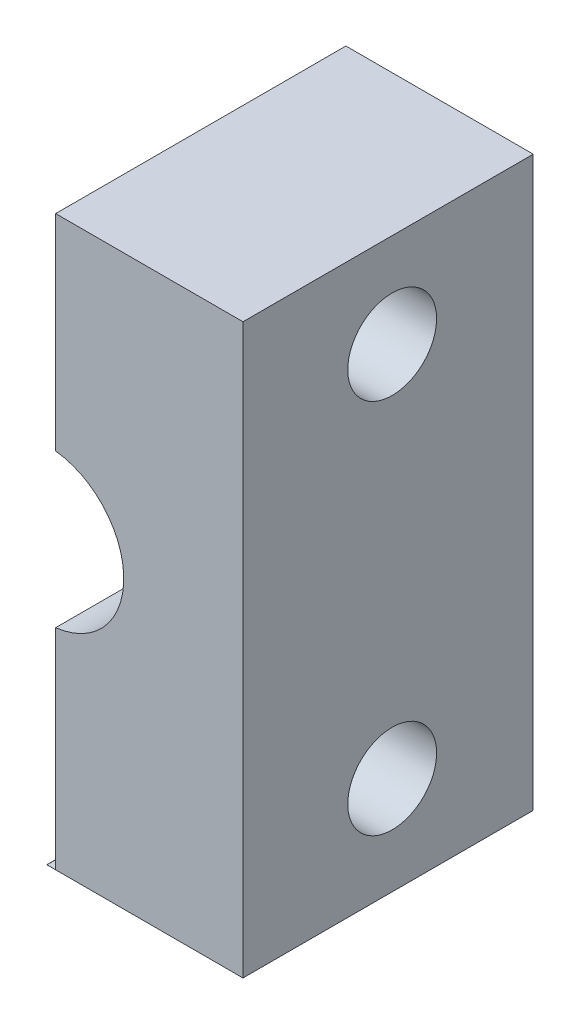
ISO-10303-21;
HEADER;
FILE_DESCRIPTION(('STEP AP214'),'2;1');
FILE_NAME('part.step','',(''),(''),'','','');
FILE_SCHEMA(('AUTOMOTIVE_DESIGN { 1 0 10303 214 1 1 1 1 }'));
ENDSEC;
DATA;
#1=APPLICATION_CONTEXT('core data for automotive mechanical design processes');
#2=APPLICATION_PROTOCOL_DEFINITION('international standard','automotive_design',2000,#1);
#3=PRODUCT_CONTEXT('',#1,'mechanical');
#4=PRODUCT('Part','Part','',(#3));
#5=PRODUCT_RELATED_PRODUCT_CATEGORY('part','',(#4));
#6=PRODUCT_DEFINITION_FORMATION('','',#4);
#7=PRODUCT_DEFINITION_CONTEXT('part definition',#1,'design');
#8=PRODUCT_DEFINITION('design','',#6,#7);
#9=PRODUCT_DEFINITION_SHAPE('','',#8);
#10=(LENGTH_UNIT() NAMED_UNIT(*) SI_UNIT(.MILLI.,.METRE.));
#11=(NAMED_UNIT(*) PLANE_ANGLE_UNIT() SI_UNIT($,.RADIAN.));
#12=(NAMED_UNIT(*) SI_UNIT($,.STERADIAN.) SOLID_ANGLE_UNIT());
#13=UNCERTAINTY_MEASURE_WITH_UNIT(LENGTH_MEASURE(1.E-05),#10,'distance_accuracy_value','');
#14=(GEOMETRIC_REPRESENTATION_CONTEXT(3) GLOBAL_UNCERTAINTY_ASSIGNED_CONTEXT((#13)) GLOBAL_UNIT_ASSIGNED_CONTEXT((#10,
#11,#12)) REPRESENTATION_CONTEXT('',''));
#15=CARTESIAN_POINT('',(0.,0.,0.));
#16=DIRECTION('',(0.,0.,1.));
#17=DIRECTION('',(1.,0.,0.));
#18=AXIS2_PLACEMENT_3D('',#15,#16,#17);
#19=CARTESIAN_POINT('',(-46.55,-9.6635978542281,9.8));
#20=DIRECTION('',(0.,1.,0.));
#21=DIRECTION('',(0.,0.,1.));
#22=AXIS2_PLACEMENT_3D('',#19,#20,#21);
#23=PLANE('',#22);
#24=DIRECTION('',(1.,0.,0.));
#25=VECTOR('',#24,1.);
#26=CARTESIAN_POINT('',(-46.55,-9.6635978542281,0.));
#27=LINE('',#26,#25);
#28=CARTESIAN_POINT('',(-46.55,-9.6635978542281,0.));
#29=VERTEX_POINT('',#28);
#30=CARTESIAN_POINT('',(-46.25,-9.6635978542281,0.));
#31=VERTEX_POINT('',#30);
#32=EDGE_CURVE('E44',#29,#31,#27,.T.);
#33=ORIENTED_EDGE('',*,*,#32,.T.);
#34=DIRECTION('',(0.,0.,1.));
#35=VECTOR('',#34,1.);
#36=CARTESIAN_POINT('',(-46.25,-9.6635978542281,9.8));
#37=LINE('',#36,#35);
#38=CARTESIAN_POINT('',(-46.25,-9.6635978542281,9.8));
#39=VERTEX_POINT('',#38);
#40=EDGE_CURVE('E72',#31,#39,#37,.T.);
#41=ORIENTED_EDGE('',*,*,#40,.T.);
#42=DIRECTION('',(1.,0.,0.));
#43=VECTOR('',#42,1.);
#44=CARTESIAN_POINT('',(-46.55,-9.6635978542281,9.8));
#45=LINE('',#44,#43);
#46=CARTESIAN_POINT('',(-46.55,-9.6635978542281,9.8));
#47=VERTEX_POINT('',#46);
#48=EDGE_CURVE('E89',#47,#39,#45,.T.);
#49=ORIENTED_EDGE('',*,*,#48,.F.);
#50=DIRECTION('',(0.,0.,-1.));
#51=VECTOR('',#50,1.);
#52=CARTESIAN_POINT('',(-46.55,-9.6635978542281,9.8));
#53=LINE('',#52,#51);
#54=EDGE_CURVE('E56',#47,#29,#53,.T.);
#55=ORIENTED_EDGE('',*,*,#54,.T.);
#56=EDGE_LOOP('',(#33,#41,#49,#55));
#57=FACE_BOUND('',#56,.T.);
#58=ADVANCED_FACE('F41',(#57),#23,.F.);
#59=CARTESIAN_POINT('',(-46.55,-4.26952432338381E-13,9.8));
#60=DIRECTION('',(0.,0.,-1.));
#61=DIRECTION('',(-1.,0.,0.));
#62=AXIS2_PLACEMENT_3D('',#59,#60,#61);
#63=PLANE('',#62);
#64=ORIENTED_EDGE('',*,*,#48,.T.);
#65=DIRECTION('',(0.999814280656352,-0.0192718498235664,0.));
#66=VECTOR('',#65,1.);
#67=CARTESIAN_POINT('',(-46.5391587007763,-9.65802419603542,9.8));
#68=LINE('',#67,#66);
#69=CARTESIAN_POINT('',(-46.5391587007763,-9.65802419603542,9.8));
#70=VERTEX_POINT('',#69);
#71=EDGE_CURVE('E79',#70,#39,#68,.T.);
#72=ORIENTED_EDGE('',*,*,#71,.F.);
#73=DIRECTION('',(0.889350089088285,0.457226879173413,0.));
#74=VECTOR('',#73,1.);
#75=CARTESIAN_POINT('',(-46.55,-9.6635978542281,9.8));
#76=LINE('',#75,#74);
#77=EDGE_CURVE('E12',#47,#70,#76,.T.);
#78=ORIENTED_EDGE('',*,*,#77,.F.);
#79=EDGE_LOOP('',(#64,#72,#78));
#80=FACE_BOUND('',#79,.T.);
#81=ADVANCED_FACE('F97',(#80),#63,.F.);
#82=CARTESIAN_POINT('',(-46.55,-4.26952432338381E-13,0.));
#83=DIRECTION('',(0.,0.,-1.));
#84=DIRECTION('',(-1.,0.,0.));
#85=AXIS2_PLACEMENT_3D('',#82,#83,#84);
#86=PLANE('',#85);
#87=DIRECTION('',(0.999814280656352,-0.0192718498235664,0.));
#88=VECTOR('',#87,1.);
#89=CARTESIAN_POINT('',(-46.5391587007763,-9.65802419603542,0.));
#90=LINE('',#89,#88);
#91=CARTESIAN_POINT('',(-46.5391587007763,-9.65802419603542,0.));
#92=VERTEX_POINT('',#91);
#93=EDGE_CURVE('E76',#92,#31,#90,.T.);
#94=ORIENTED_EDGE('',*,*,#93,.T.);
#95=ORIENTED_EDGE('',*,*,#32,.F.);
#96=DIRECTION('',(0.889350089088285,0.457226879173413,0.));
#97=VECTOR('',#96,1.);
#98=CARTESIAN_POINT('',(-46.55,-9.6635978542281,0.));
#99=LINE('',#98,#97);
#100=EDGE_CURVE('E88',#29,#92,#99,.T.);
#101=ORIENTED_EDGE('',*,*,#100,.T.);
#102=EDGE_LOOP('',(#94,#95,#101));
#103=FACE_BOUND('',#102,.T.);
#104=ADVANCED_FACE('F87',(#103),#86,.T.);
#105=CARTESIAN_POINT('',(-46.5391587007763,-9.65802419603542,0.));
#106=DIRECTION('',(-0.0192718498235664,-0.999814280656352,0.));
#107=DIRECTION('',(0.999814280656352,-0.0192718498235664,0.));
#108=AXIS2_PLACEMENT_3D('',#105,#106,#107);
#109=PLANE('',#108);
#110=ORIENTED_EDGE('',*,*,#71,.T.);
#111=ORIENTED_EDGE('',*,*,#40,.F.);
#112=ORIENTED_EDGE('',*,*,#93,.F.);
#113=DIRECTION('',(0.,0.,1.));
#114=VECTOR('',#113,1.);
#115=CARTESIAN_POINT('',(-46.5391587007763,-9.65802419603542,0.));
#116=LINE('',#115,#114);
#117=EDGE_CURVE('E50',#92,#70,#116,.T.);
#118=ORIENTED_EDGE('',*,*,#117,.T.);
#119=EDGE_LOOP('',(#110,#111,#112,#118));
#120=FACE_BOUND('',#119,.T.);
#121=ADVANCED_FACE('F74',(#120),#109,.F.);
#122=CARTESIAN_POINT('',(-46.55,-9.6635978542281,0.));
#123=DIRECTION('',(0.457226879173414,-0.889350089088285,0.));
#124=DIRECTION('',(0.889350089088285,0.457226879173413,0.));
#125=AXIS2_PLACEMENT_3D('',#122,#123,#124);
#126=PLANE('',#125);
#127=ORIENTED_EDGE('',*,*,#77,.T.);
#128=ORIENTED_EDGE('',*,*,#117,.F.);
#129=ORIENTED_EDGE('',*,*,#100,.F.);
#130=ORIENTED_EDGE('',*,*,#54,.F.);
#131=EDGE_LOOP('',(#127,#128,#129,#130));
#132=FACE_BOUND('',#131,.T.);
#133=ADVANCED_FACE('F95',(#132),#126,.F.);
#134=CLOSED_SHELL('',(#58,#81,#104,#121,#133));
#135=MANIFOLD_SOLID_BREP('B2',#134);
#136=CARTESIAN_POINT('',(-46.55,-4.26952432338381E-13,9.8));
#137=DIRECTION('',(0.,0.,-1.));
#138=DIRECTION('',(-1.,0.,0.));
#139=AXIS2_PLACEMENT_3D('',#136,#137,#138);
#140=PLANE('',#139);
#141=DIRECTION('',(-1.,0.,0.));
#142=VECTOR('',#141,1.);
#143=CARTESIAN_POINT('',(-46.55,9.525,9.8));
#144=LINE('',#143,#142);
#145=CARTESIAN_POINT('',(-39.925,9.525,9.8));
#146=VERTEX_POINT('',#145);
#147=CARTESIAN_POINT('',(-46.25,9.525,9.8));
#148=VERTEX_POINT('',#147);
#149=EDGE_CURVE('E224',#146,#148,#144,.T.);
#150=ORIENTED_EDGE('',*,*,#149,.T.);
#151=DIRECTION('',(0.,1.,0.));
#152=VECTOR('',#151,1.);
#153=CARTESIAN_POINT('',(-46.25,9.525,9.8));
#154=LINE('',#153,#152);
#155=CARTESIAN_POINT('',(-46.25,2.58263431402899,9.8));
#156=VERTEX_POINT('',#155);
#157=EDGE_CURVE('E251',#156,#148,#154,.T.);
#158=ORIENTED_EDGE('',*,*,#157,.F.);
#159=CARTESIAN_POINT('',(-46.55,-4.26952432338381E-13,9.8));
#160=DIRECTION('',(0.,0.,-1.));
#161=DIRECTION('',(-1.,0.,0.));
#162=AXIS2_PLACEMENT_3D('',#159,#160,#161);
#163=CIRCLE('',#162,2.60000000000043);
#164=CARTESIAN_POINT('',(-46.25,-2.58263431402985,9.8));
#165=VERTEX_POINT('',#164);
#166=EDGE_CURVE('E222',#156,#165,#163,.T.);
#167=ORIENTED_EDGE('',*,*,#166,.T.);
#168=CARTESIAN_POINT('',(-46.25,-9.6635978542281,9.8));
#169=VERTEX_POINT('',#168);
#170=EDGE_CURVE('E250',#169,#165,#154,.T.);
#171=ORIENTED_EDGE('',*,*,#170,.F.);
#172=DIRECTION('',(1.,0.,0.));
#173=VECTOR('',#172,1.);
#174=CARTESIAN_POINT('',(-46.55,-9.6635978542281,9.8));
#175=LINE('',#174,#173);
#176=CARTESIAN_POINT('',(-39.925,-9.6635978542281,9.8));
#177=VERTEX_POINT('',#176);
#178=EDGE_CURVE('E205',#169,#177,#175,.T.);
#179=ORIENTED_EDGE('',*,*,#178,.T.);
#180=DIRECTION('',(0.,1.,0.));
#181=VECTOR('',#180,1.);
#182=CARTESIAN_POINT('',(-39.925,-9.6635978542281,9.8));
#183=LINE('',#182,#181);
#184=EDGE_CURVE('E229',#177,#146,#183,.T.);
#185=ORIENTED_EDGE('',*,*,#184,.T.);
#186=EDGE_LOOP('',(#150,#158,#167,#171,#179,#185));
#187=FACE_BOUND('',#186,.T.);
#188=ADVANCED_FACE('F139',(#187),#140,.F.);
#189=CARTESIAN_POINT('',(-46.55,-4.26952432338381E-13,0.));
#190=DIRECTION('',(0.,0.,-1.));
#191=DIRECTION('',(-1.,0.,0.));
#192=AXIS2_PLACEMENT_3D('',#189,#190,#191);
#193=PLANE('',#192);
#194=DIRECTION('',(0.,1.,0.));
#195=VECTOR('',#194,1.);
#196=CARTESIAN_POINT('',(-46.25,9.525,0.));
#197=LINE('',#196,#195);
#198=CARTESIAN_POINT('',(-46.25,2.58263431402899,0.));
#199=VERTEX_POINT('',#198);
#200=CARTESIAN_POINT('',(-46.25,9.525,0.));
#201=VERTEX_POINT('',#200);
#202=EDGE_CURVE('E199',#199,#201,#197,.T.);
#203=ORIENTED_EDGE('',*,*,#202,.T.);
#204=DIRECTION('',(-1.,0.,0.));
#205=VECTOR('',#204,1.);
#206=CARTESIAN_POINT('',(-46.55,9.525,0.));
#207=LINE('',#206,#205);
#208=CARTESIAN_POINT('',(-39.925,9.525,0.));
#209=VERTEX_POINT('',#208);
#210=EDGE_CURVE('E214',#209,#201,#207,.T.);
#211=ORIENTED_EDGE('',*,*,#210,.F.);
#212=DIRECTION('',(0.,1.,0.));
#213=VECTOR('',#212,1.);
#214=CARTESIAN_POINT('',(-39.925,-9.6635978542281,0.));
#215=LINE('',#214,#213);
#216=CARTESIAN_POINT('',(-39.925,-9.6635978542281,0.));
#217=VERTEX_POINT('',#216);
#218=EDGE_CURVE('E211',#217,#209,#215,.T.);
#219=ORIENTED_EDGE('',*,*,#218,.F.);
#220=DIRECTION('',(1.,0.,0.));
#221=VECTOR('',#220,1.);
#222=CARTESIAN_POINT('',(-46.55,-9.6635978542281,0.));
#223=LINE('',#222,#221);
#224=CARTESIAN_POINT('',(-46.25,-9.6635978542281,0.));
#225=VERTEX_POINT('',#224);
#226=EDGE_CURVE('E204',#225,#217,#223,.T.);
#227=ORIENTED_EDGE('',*,*,#226,.F.);
#228=CARTESIAN_POINT('',(-46.25,-2.58263431402985,0.));
#229=VERTEX_POINT('',#228);
#230=EDGE_CURVE('E191',#225,#229,#197,.T.);
#231=ORIENTED_EDGE('',*,*,#230,.T.);
#232=CARTESIAN_POINT('',(-46.55,-4.26952432338381E-13,0.));
#233=DIRECTION('',(0.,0.,-1.));
#234=DIRECTION('',(-1.,0.,0.));
#235=AXIS2_PLACEMENT_3D('',#232,#233,#234);
#236=CIRCLE('',#235,2.60000000000043);
#237=EDGE_CURVE('E212',#199,#229,#236,.T.);
#238=ORIENTED_EDGE('',*,*,#237,.F.);
#239=EDGE_LOOP('',(#203,#211,#219,#227,#231,#238));
#240=FACE_BOUND('',#239,.T.);
#241=ADVANCED_FACE('F209',(#240),#193,.T.);
#242=CARTESIAN_POINT('',(-46.55,9.525,9.8));
#243=DIRECTION('',(0.,-1.,0.));
#244=DIRECTION('',(0.,0.,-1.));
#245=AXIS2_PLACEMENT_3D('',#242,#243,#244);
#246=PLANE('',#245);
#247=ORIENTED_EDGE('',*,*,#210,.T.);
#248=DIRECTION('',(0.,0.,1.));
#249=VECTOR('',#248,1.);
#250=CARTESIAN_POINT('',(-46.25,9.525,0.));
#251=LINE('',#250,#249);
#252=EDGE_CURVE('E163',#201,#148,#251,.T.);
#253=ORIENTED_EDGE('',*,*,#252,.T.);
#254=ORIENTED_EDGE('',*,*,#149,.F.);
#255=DIRECTION('',(0.,0.,-1.));
#256=VECTOR('',#255,1.);
#257=CARTESIAN_POINT('',(-39.925,9.525,9.8));
#258=LINE('',#257,#256);
#259=EDGE_CURVE('E148',#146,#209,#258,.T.);
#260=ORIENTED_EDGE('',*,*,#259,.T.);
#261=EDGE_LOOP('',(#247,#253,#254,#260));
#262=FACE_BOUND('',#261,.T.);
#263=ADVANCED_FACE('F254',(#262),#246,.F.);
#264=CARTESIAN_POINT('',(-46.55,-9.6635978542281,9.8));
#265=DIRECTION('',(0.,1.,0.));
#266=DIRECTION('',(0.,0.,1.));
#267=AXIS2_PLACEMENT_3D('',#264,#265,#266);
#268=PLANE('',#267);
#269=DIRECTION('',(0.,0.,1.));
#270=VECTOR('',#269,1.);
#271=CARTESIAN_POINT('',(-46.25,-9.6635978542281,0.));
#272=LINE('',#271,#270);
#273=EDGE_CURVE('E155',#225,#169,#272,.T.);
#274=ORIENTED_EDGE('',*,*,#273,.F.);
#275=ORIENTED_EDGE('',*,*,#226,.T.);
#276=DIRECTION('',(0.,0.,-1.));
#277=VECTOR('',#276,1.);
#278=CARTESIAN_POINT('',(-39.925,-9.6635978542281,9.8));
#279=LINE('',#278,#277);
#280=EDGE_CURVE('E39',#177,#217,#279,.T.);
#281=ORIENTED_EDGE('',*,*,#280,.F.);
#282=ORIENTED_EDGE('',*,*,#178,.F.);
#283=EDGE_LOOP('',(#274,#275,#281,#282));
#284=FACE_BOUND('',#283,.T.);
#285=ADVANCED_FACE('F202',(#284),#268,.F.);
#286=CARTESIAN_POINT('',(-46.55,-4.26952432338381E-13,9.8));
#287=DIRECTION('',(0.,0.,-1.));
#288=DIRECTION('',(-1.,0.,0.));
#289=AXIS2_PLACEMENT_3D('',#286,#287,#288);
#290=CYLINDRICAL_SURFACE('',#289,2.60000000000043);
#291=ORIENTED_EDGE('',*,*,#237,.T.);
#292=DIRECTION('',(0.,0.,-1.));
#293=VECTOR('',#292,1.);
#294=CARTESIAN_POINT('',(-46.25,-2.58263431402985,9.8));
#295=LINE('',#294,#293);
#296=EDGE_CURVE('E194',#229,#165,#295,.F.);
#297=ORIENTED_EDGE('',*,*,#296,.T.);
#298=ORIENTED_EDGE('',*,*,#166,.F.);
#299=DIRECTION('',(0.,0.,-1.));
#300=VECTOR('',#299,1.);
#301=CARTESIAN_POINT('',(-46.25,2.58263431402899,9.8));
#302=LINE('',#301,#300);
#303=EDGE_CURVE('E243',#156,#199,#302,.T.);
#304=ORIENTED_EDGE('',*,*,#303,.T.);
#305=EDGE_LOOP('',(#291,#297,#298,#304));
#306=FACE_BOUND('',#305,.T.);
#307=ADVANCED_FACE('F141',(#306),#290,.F.);
#308=CARTESIAN_POINT('',(-50.7926406871193,6.35000000000002,4.7625));
#309=DIRECTION('',(1.,0.,0.));
#310=DIRECTION('',(0.,1.,0.));
#311=AXIS2_PLACEMENT_3D('',#308,#309,#310);
#312=CYLINDRICAL_SURFACE('',#311,1.5);
#313=CARTESIAN_POINT('',(-46.25,6.35000000000002,4.7625));
#314=DIRECTION('',(1.,0.,0.));
#315=DIRECTION('',(0.,0.,-1.));
#316=AXIS2_PLACEMENT_3D('',#313,#314,#315);
#317=CIRCLE('',#316,1.5);
#318=CARTESIAN_POINT('',(-46.25,6.35000000000002,3.2625));
#319=VERTEX_POINT('',#318);
#320=EDGE_CURVE('E246',#319,#319,#317,.F.);
#321=ORIENTED_EDGE('',*,*,#320,.T.);
#322=EDGE_LOOP('',(#321));
#323=FACE_BOUND('',#322,.T.);
#324=CARTESIAN_POINT('',(-39.925,6.35000000000001,4.7625));
#325=DIRECTION('',(1.,0.,0.));
#326=DIRECTION('',(0.,1.,0.));
#327=AXIS2_PLACEMENT_3D('',#324,#325,#326);
#328=CIRCLE('',#327,1.5);
#329=CARTESIAN_POINT('',(-39.925,7.85000000000001,4.7625));
#330=VERTEX_POINT('',#329);
#331=EDGE_CURVE('E216',#330,#330,#328,.T.);
#332=ORIENTED_EDGE('',*,*,#331,.T.);
#333=EDGE_LOOP('',(#332));
#334=FACE_BOUND('',#333,.T.);
#335=ADVANCED_FACE('F261',(#323,#334),#312,.F.);
#336=CARTESIAN_POINT('',(-39.925,-9.6635978542281,9.8));
#337=DIRECTION('',(-1.,0.,0.));
#338=DIRECTION('',(0.,-1.,0.));
#339=AXIS2_PLACEMENT_3D('',#336,#337,#338);
#340=PLANE('',#339);
#341=CARTESIAN_POINT('',(-39.925,-6.34999999999999,4.7625));
#342=DIRECTION('',(1.,0.,0.));
#343=DIRECTION('',(0.,1.,0.));
#344=AXIS2_PLACEMENT_3D('',#341,#342,#343);
#345=CIRCLE('',#344,1.5);
#346=CARTESIAN_POINT('',(-39.925,-4.84999999999998,4.7625));
#347=VERTEX_POINT('',#346);
#348=EDGE_CURVE('E239',#347,#347,#345,.T.);
#349=ORIENTED_EDGE('',*,*,#348,.F.);
#350=EDGE_LOOP('',(#349));
#351=FACE_BOUND('',#350,.T.);
#352=ORIENTED_EDGE('',*,*,#331,.F.);
#353=EDGE_LOOP('',(#352));
#354=FACE_BOUND('',#353,.T.);
#355=ORIENTED_EDGE('',*,*,#218,.T.);
#356=ORIENTED_EDGE('',*,*,#259,.F.);
#357=ORIENTED_EDGE('',*,*,#184,.F.);
#358=ORIENTED_EDGE('',*,*,#280,.T.);
#359=EDGE_LOOP('',(#355,#356,#357,#358));
#360=FACE_BOUND('',#359,.T.);
#361=ADVANCED_FACE('F258',(#351,#354,#360),#340,.F.);
#362=CARTESIAN_POINT('',(-50.7926406871193,-6.34999999999998,4.7625));
#363=DIRECTION('',(1.,0.,0.));
#364=DIRECTION('',(0.,1.,0.));
#365=AXIS2_PLACEMENT_3D('',#362,#363,#364);
#366=CYLINDRICAL_SURFACE('',#365,1.5);
#367=CARTESIAN_POINT('',(-46.25,-6.34999999999998,4.7625));
#368=DIRECTION('',(1.,0.,0.));
#369=DIRECTION('',(0.,0.,-1.));
#370=AXIS2_PLACEMENT_3D('',#367,#368,#369);
#371=CIRCLE('',#370,1.5);
#372=CARTESIAN_POINT('',(-46.25,-6.34999999999998,3.2625));
#373=VERTEX_POINT('',#372);
#374=EDGE_CURVE('E143',#373,#373,#371,.F.);
#375=ORIENTED_EDGE('',*,*,#374,.T.);
#376=EDGE_LOOP('',(#375));
#377=FACE_BOUND('',#376,.T.);
#378=ORIENTED_EDGE('',*,*,#348,.T.);
#379=EDGE_LOOP('',(#378));
#380=FACE_BOUND('',#379,.T.);
#381=ADVANCED_FACE('F260',(#377,#380),#366,.F.);
#382=CARTESIAN_POINT('',(-46.25,9.525,0.));
#383=DIRECTION('',(1.,0.,0.));
#384=DIRECTION('',(0.,0.,-1.));
#385=AXIS2_PLACEMENT_3D('',#382,#383,#384);
#386=PLANE('',#385);
#387=ORIENTED_EDGE('',*,*,#374,.F.);
#388=EDGE_LOOP('',(#387));
#389=FACE_BOUND('',#388,.T.);
#390=ORIENTED_EDGE('',*,*,#230,.F.);
#391=ORIENTED_EDGE('',*,*,#273,.T.);
#392=ORIENTED_EDGE('',*,*,#170,.T.);
#393=ORIENTED_EDGE('',*,*,#296,.F.);
#394=EDGE_LOOP('',(#390,#391,#392,#393));
#395=FACE_BOUND('',#394,.T.);
#396=ADVANCED_FACE('F192',(#389,#395),#386,.F.);
#397=ORIENTED_EDGE('',*,*,#320,.F.);
#398=EDGE_LOOP('',(#397));
#399=FACE_BOUND('',#398,.T.);
#400=ORIENTED_EDGE('',*,*,#157,.T.);
#401=ORIENTED_EDGE('',*,*,#252,.F.);
#402=ORIENTED_EDGE('',*,*,#202,.F.);
#403=ORIENTED_EDGE('',*,*,#303,.F.);
#404=EDGE_LOOP('',(#400,#401,#402,#403));
#405=FACE_BOUND('',#404,.T.);
#406=ADVANCED_FACE('F252',(#399,#405),#386,.F.);
#407=CLOSED_SHELL('',(#188,#241,#263,#285,#307,#335,#361,#381,#396,#406));
#408=MANIFOLD_SOLID_BREP('B6',#407);
#409=ADVANCED_BREP_SHAPE_REPRESENTATION('',(#18,#135,#408),#14);
#410=SHAPE_DEFINITION_REPRESENTATION(#9,#409);
ENDSEC;
END-ISO-10303-21;
